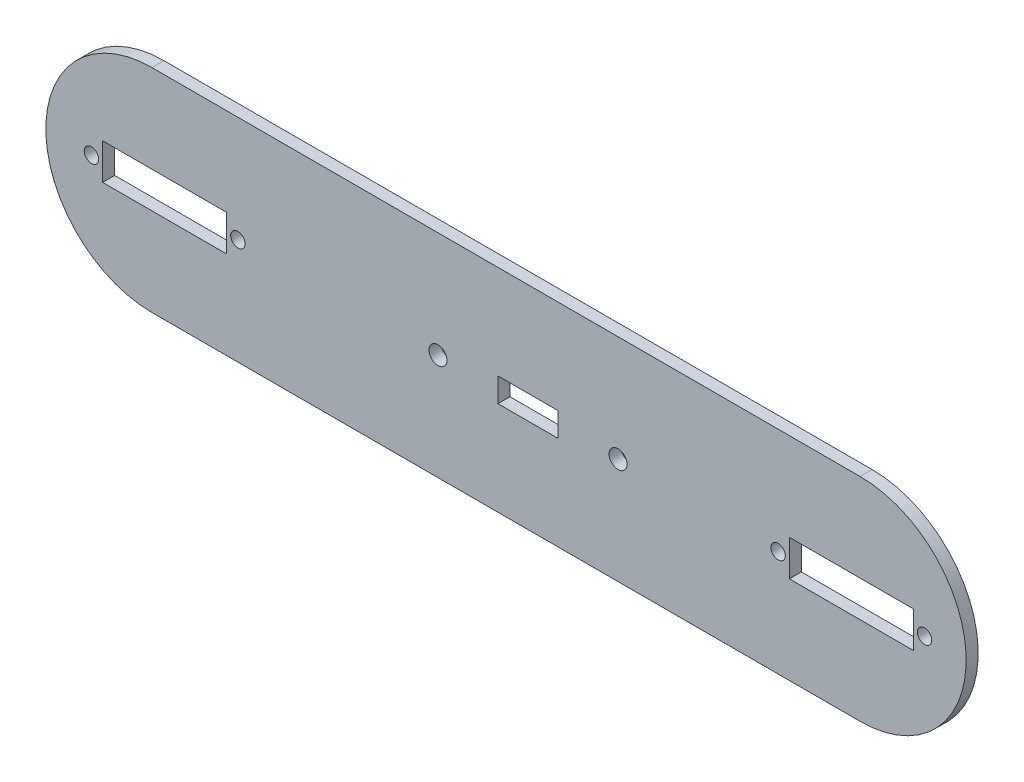
ISO-10303-21;
HEADER;
FILE_DESCRIPTION(('STEP AP214'),'2;1');
FILE_NAME('part.step','',(''),(''),'','','');
FILE_SCHEMA(('AUTOMOTIVE_DESIGN { 1 0 10303 214 1 1 1 1 }'));
ENDSEC;
DATA;
#1=APPLICATION_CONTEXT('core data for automotive mechanical design processes');
#2=APPLICATION_PROTOCOL_DEFINITION('international standard','automotive_design',2000,#1);
#3=PRODUCT_CONTEXT('',#1,'mechanical');
#4=PRODUCT('Part','Part','',(#3));
#5=PRODUCT_RELATED_PRODUCT_CATEGORY('part','',(#4));
#6=PRODUCT_DEFINITION_FORMATION('','',#4);
#7=PRODUCT_DEFINITION_CONTEXT('part definition',#1,'design');
#8=PRODUCT_DEFINITION('design','',#6,#7);
#9=PRODUCT_DEFINITION_SHAPE('','',#8);
#10=(LENGTH_UNIT() NAMED_UNIT(*) SI_UNIT(.MILLI.,.METRE.));
#11=(NAMED_UNIT(*) PLANE_ANGLE_UNIT() SI_UNIT($,.RADIAN.));
#12=(NAMED_UNIT(*) SI_UNIT($,.STERADIAN.) SOLID_ANGLE_UNIT());
#13=UNCERTAINTY_MEASURE_WITH_UNIT(LENGTH_MEASURE(1.E-05),#10,'distance_accuracy_value','');
#14=(GEOMETRIC_REPRESENTATION_CONTEXT(3) GLOBAL_UNCERTAINTY_ASSIGNED_CONTEXT((#13)) GLOBAL_UNIT_ASSIGNED_CONTEXT((#10,
#11,#12)) REPRESENTATION_CONTEXT('',''));
#15=CARTESIAN_POINT('',(0.,0.,0.));
#16=DIRECTION('',(0.,0.,1.));
#17=DIRECTION('',(1.,0.,0.));
#18=AXIS2_PLACEMENT_3D('',#15,#16,#17);
#19=CARTESIAN_POINT('',(-94.,0.,3.));
#20=DIRECTION('',(0.,0.,1.));
#21=DIRECTION('',(1.,0.,0.));
#22=AXIS2_PLACEMENT_3D('',#19,#20,#21);
#23=PLANE('',#22);
#24=CARTESIAN_POINT('',(62.5,0.,3.));
#25=DIRECTION('',(0.,0.,1.));
#26=DIRECTION('',(-1.,0.,0.));
#27=AXIS2_PLACEMENT_3D('',#24,#25,#26);
#28=CIRCLE('',#27,1.79999999999999);
#29=CARTESIAN_POINT('',(60.7,0.,3.));
#30=VERTEX_POINT('',#29);
#31=EDGE_CURVE('E219',#30,#30,#28,.T.);
#32=ORIENTED_EDGE('',*,*,#31,.F.);
#33=EDGE_LOOP('',(#32));
#34=FACE_BOUND('',#33,.T.);
#35=CARTESIAN_POINT('',(-109.1,0.,3.));
#36=DIRECTION('',(0.,0.,1.));
#37=DIRECTION('',(1.,0.,0.));
#38=AXIS2_PLACEMENT_3D('',#35,#36,#37);
#39=CIRCLE('',#38,1.79999999999999);
#40=CARTESIAN_POINT('',(-107.3,0.,3.));
#41=VERTEX_POINT('',#40);
#42=EDGE_CURVE('E231',#41,#41,#39,.T.);
#43=ORIENTED_EDGE('',*,*,#42,.F.);
#44=EDGE_LOOP('',(#43));
#45=FACE_BOUND('',#44,.T.);
#46=DIRECTION('',(-1.,0.,0.));
#47=VECTOR('',#46,1.);
#48=CARTESIAN_POINT('',(-7.5,3.,3.));
#49=LINE('',#48,#47);
#50=CARTESIAN_POINT('',(7.5,3.,3.));
#51=VERTEX_POINT('',#50);
#52=CARTESIAN_POINT('',(-7.5,3.,3.));
#53=VERTEX_POINT('',#52);
#54=EDGE_CURVE('E245',#51,#53,#49,.T.);
#55=ORIENTED_EDGE('',*,*,#54,.F.);
#56=DIRECTION('',(0.,1.,0.));
#57=VECTOR('',#56,1.);
#58=CARTESIAN_POINT('',(7.5,-3.,3.));
#59=LINE('',#58,#57);
#60=CARTESIAN_POINT('',(7.5,-3.,3.));
#61=VERTEX_POINT('',#60);
#62=EDGE_CURVE('E243',#61,#51,#59,.T.);
#63=ORIENTED_EDGE('',*,*,#62,.F.);
#64=DIRECTION('',(1.,0.,0.));
#65=VECTOR('',#64,1.);
#66=CARTESIAN_POINT('',(-7.5,-3.,3.));
#67=LINE('',#66,#65);
#68=CARTESIAN_POINT('',(-7.49999999999999,-3.,3.));
#69=VERTEX_POINT('',#68);
#70=EDGE_CURVE('E251',#69,#61,#67,.T.);
#71=ORIENTED_EDGE('',*,*,#70,.F.);
#72=DIRECTION('',(0.,-1.,0.));
#73=VECTOR('',#72,1.);
#74=CARTESIAN_POINT('',(-7.5,-3.,3.));
#75=LINE('',#74,#73);
#76=EDGE_CURVE('E248',#53,#69,#75,.T.);
#77=ORIENTED_EDGE('',*,*,#76,.F.);
#78=EDGE_LOOP('',(#55,#63,#71,#77));
#79=FACE_BOUND('',#78,.T.);
#80=CARTESIAN_POINT('',(-22.5,0.,3.));
#81=DIRECTION('',(0.,0.,1.));
#82=DIRECTION('',(1.,0.,0.));
#83=AXIS2_PLACEMENT_3D('',#80,#81,#82);
#84=CIRCLE('',#83,2.25);
#85=CARTESIAN_POINT('',(-20.25,0.,3.));
#86=VERTEX_POINT('',#85);
#87=EDGE_CURVE('E274',#86,#86,#84,.T.);
#88=ORIENTED_EDGE('',*,*,#87,.F.);
#89=EDGE_LOOP('',(#88));
#90=FACE_BOUND('',#89,.T.);
#91=CARTESIAN_POINT('',(-94.,0.,3.));
#92=DIRECTION('',(0.,0.,1.));
#93=DIRECTION('',(1.,0.,0.));
#94=AXIS2_PLACEMENT_3D('',#91,#92,#93);
#95=CIRCLE('',#94,26.5);
#96=CARTESIAN_POINT('',(-94.,26.5,3.));
#97=VERTEX_POINT('',#96);
#98=CARTESIAN_POINT('',(-94.,-26.5,3.));
#99=VERTEX_POINT('',#98);
#100=EDGE_CURVE('E280',#97,#99,#95,.T.);
#101=ORIENTED_EDGE('',*,*,#100,.T.);
#102=DIRECTION('',(1.,0.,0.));
#103=VECTOR('',#102,1.);
#104=CARTESIAN_POINT('',(-94.,-26.5,3.));
#105=LINE('',#104,#103);
#106=CARTESIAN_POINT('',(83.,-26.5,3.));
#107=VERTEX_POINT('',#106);
#108=EDGE_CURVE('E283',#99,#107,#105,.T.);
#109=ORIENTED_EDGE('',*,*,#108,.T.);
#110=CARTESIAN_POINT('',(83.,0.,3.));
#111=DIRECTION('',(0.,0.,1.));
#112=DIRECTION('',(1.,0.,0.));
#113=AXIS2_PLACEMENT_3D('',#110,#111,#112);
#114=CIRCLE('',#113,26.5);
#115=CARTESIAN_POINT('',(83.,26.5,3.));
#116=VERTEX_POINT('',#115);
#117=EDGE_CURVE('E286',#107,#116,#114,.T.);
#118=ORIENTED_EDGE('',*,*,#117,.T.);
#119=DIRECTION('',(-1.,0.,0.));
#120=VECTOR('',#119,1.);
#121=CARTESIAN_POINT('',(-94.,26.5,3.));
#122=LINE('',#121,#120);
#123=EDGE_CURVE('E288',#116,#97,#122,.T.);
#124=ORIENTED_EDGE('',*,*,#123,.T.);
#125=EDGE_LOOP('',(#101,#109,#118,#124));
#126=FACE_BOUND('',#125,.T.);
#127=CARTESIAN_POINT('',(22.5,0.,3.));
#128=DIRECTION('',(0.,0.,1.));
#129=DIRECTION('',(1.,0.,0.));
#130=AXIS2_PLACEMENT_3D('',#127,#128,#129);
#131=CIRCLE('',#130,2.25);
#132=CARTESIAN_POINT('',(24.75,0.,3.));
#133=VERTEX_POINT('',#132);
#134=EDGE_CURVE('E237',#133,#133,#131,.T.);
#135=ORIENTED_EDGE('',*,*,#134,.F.);
#136=EDGE_LOOP('',(#135));
#137=FACE_BOUND('',#136,.T.);
#138=CARTESIAN_POINT('',(-72.5,0.,3.));
#139=DIRECTION('',(0.,0.,1.));
#140=DIRECTION('',(1.,0.,0.));
#141=AXIS2_PLACEMENT_3D('',#138,#139,#140);
#142=CIRCLE('',#141,1.79999999999999);
#143=CARTESIAN_POINT('',(-70.7,0.,3.));
#144=VERTEX_POINT('',#143);
#145=EDGE_CURVE('E225',#144,#144,#142,.T.);
#146=ORIENTED_EDGE('',*,*,#145,.F.);
#147=EDGE_LOOP('',(#146));
#148=FACE_BOUND('',#147,.T.);
#149=CARTESIAN_POINT('',(99.1,0.,3.));
#150=DIRECTION('',(0.,0.,1.));
#151=DIRECTION('',(-1.,0.,0.));
#152=AXIS2_PLACEMENT_3D('',#149,#150,#151);
#153=CIRCLE('',#152,1.79999999999999);
#154=CARTESIAN_POINT('',(97.3,0.,3.));
#155=VERTEX_POINT('',#154);
#156=EDGE_CURVE('E213',#155,#155,#153,.T.);
#157=ORIENTED_EDGE('',*,*,#156,.F.);
#158=EDGE_LOOP('',(#157));
#159=FACE_BOUND('',#158,.T.);
#160=DIRECTION('',(-1.,0.,0.));
#161=VECTOR('',#160,1.);
#162=CARTESIAN_POINT('',(-106.3,4.5,3.));
#163=LINE('',#162,#161);
#164=CARTESIAN_POINT('',(-75.3000000000001,4.5,3.));
#165=VERTEX_POINT('',#164);
#166=CARTESIAN_POINT('',(-106.3,4.5,3.));
#167=VERTEX_POINT('',#166);
#168=EDGE_CURVE('E184',#165,#167,#163,.T.);
#169=ORIENTED_EDGE('',*,*,#168,.F.);
#170=DIRECTION('',(0.,1.,0.));
#171=VECTOR('',#170,1.);
#172=CARTESIAN_POINT('',(-75.3000000000001,-4.5,3.));
#173=LINE('',#172,#171);
#174=CARTESIAN_POINT('',(-75.3000000000001,-4.5,3.));
#175=VERTEX_POINT('',#174);
#176=EDGE_CURVE('E182',#175,#165,#173,.T.);
#177=ORIENTED_EDGE('',*,*,#176,.F.);
#178=DIRECTION('',(1.,0.,0.));
#179=VECTOR('',#178,1.);
#180=CARTESIAN_POINT('',(-106.3,-4.5,3.));
#181=LINE('',#180,#179);
#182=CARTESIAN_POINT('',(-106.3,-4.5,3.));
#183=VERTEX_POINT('',#182);
#184=EDGE_CURVE('E190',#183,#175,#181,.T.);
#185=ORIENTED_EDGE('',*,*,#184,.F.);
#186=DIRECTION('',(0.,-1.,0.));
#187=VECTOR('',#186,1.);
#188=CARTESIAN_POINT('',(-106.3,4.5,3.));
#189=LINE('',#188,#187);
#190=EDGE_CURVE('E187',#167,#183,#189,.T.);
#191=ORIENTED_EDGE('',*,*,#190,.F.);
#192=EDGE_LOOP('',(#169,#177,#185,#191));
#193=FACE_BOUND('',#192,.T.);
#194=DIRECTION('',(-1.,0.,0.));
#195=VECTOR('',#194,1.);
#196=CARTESIAN_POINT('',(65.3,4.5,3.));
#197=LINE('',#196,#195);
#198=CARTESIAN_POINT('',(96.3,4.5,3.));
#199=VERTEX_POINT('',#198);
#200=CARTESIAN_POINT('',(65.3,4.5,3.));
#201=VERTEX_POINT('',#200);
#202=EDGE_CURVE('E154',#199,#201,#197,.T.);
#203=ORIENTED_EDGE('',*,*,#202,.F.);
#204=DIRECTION('',(0.,1.,0.));
#205=VECTOR('',#204,1.);
#206=CARTESIAN_POINT('',(96.3,-4.5,3.));
#207=LINE('',#206,#205);
#208=CARTESIAN_POINT('',(96.3,-4.5,3.));
#209=VERTEX_POINT('',#208);
#210=EDGE_CURVE('E146',#209,#199,#207,.T.);
#211=ORIENTED_EDGE('',*,*,#210,.F.);
#212=DIRECTION('',(1.,0.,0.));
#213=VECTOR('',#212,1.);
#214=CARTESIAN_POINT('',(65.3,-4.5,3.));
#215=LINE('',#214,#213);
#216=CARTESIAN_POINT('',(65.3,-4.5,3.));
#217=VERTEX_POINT('',#216);
#218=EDGE_CURVE('E168',#217,#209,#215,.T.);
#219=ORIENTED_EDGE('',*,*,#218,.F.);
#220=DIRECTION('',(0.,-1.,0.));
#221=VECTOR('',#220,1.);
#222=CARTESIAN_POINT('',(65.3,-4.5,3.));
#223=LINE('',#222,#221);
#224=EDGE_CURVE('E166',#201,#217,#223,.T.);
#225=ORIENTED_EDGE('',*,*,#224,.F.);
#226=EDGE_LOOP('',(#203,#211,#219,#225));
#227=FACE_BOUND('',#226,.T.);
#228=ADVANCED_FACE('F33',(#34,#45,#79,#90,#126,#137,#148,#159,#193,#227),#23,.T.);
#229=CARTESIAN_POINT('',(-94.,0.,0.));
#230=DIRECTION('',(0.,0.,1.));
#231=DIRECTION('',(1.,0.,0.));
#232=AXIS2_PLACEMENT_3D('',#229,#230,#231);
#233=PLANE('',#232);
#234=DIRECTION('',(0.,1.,0.));
#235=VECTOR('',#234,1.);
#236=CARTESIAN_POINT('',(-75.3000000000001,-4.5,0.));
#237=LINE('',#236,#235);
#238=CARTESIAN_POINT('',(-75.3000000000001,-4.5,0.));
#239=VERTEX_POINT('',#238);
#240=CARTESIAN_POINT('',(-75.3000000000001,4.5,0.));
#241=VERTEX_POINT('',#240);
#242=EDGE_CURVE('E162',#239,#241,#237,.T.);
#243=ORIENTED_EDGE('',*,*,#242,.T.);
#244=DIRECTION('',(-1.,0.,0.));
#245=VECTOR('',#244,1.);
#246=CARTESIAN_POINT('',(-106.3,4.5,0.));
#247=LINE('',#246,#245);
#248=CARTESIAN_POINT('',(-106.3,4.5,0.));
#249=VERTEX_POINT('',#248);
#250=EDGE_CURVE('E195',#241,#249,#247,.T.);
#251=ORIENTED_EDGE('',*,*,#250,.T.);
#252=DIRECTION('',(0.,-1.,0.));
#253=VECTOR('',#252,1.);
#254=CARTESIAN_POINT('',(-106.3,4.5,0.));
#255=LINE('',#254,#253);
#256=CARTESIAN_POINT('',(-106.3,-4.5,0.));
#257=VERTEX_POINT('',#256);
#258=EDGE_CURVE('E198',#249,#257,#255,.T.);
#259=ORIENTED_EDGE('',*,*,#258,.T.);
#260=DIRECTION('',(1.,0.,0.));
#261=VECTOR('',#260,1.);
#262=CARTESIAN_POINT('',(-106.3,-4.5,0.));
#263=LINE('',#262,#261);
#264=EDGE_CURVE('E185',#257,#239,#263,.T.);
#265=ORIENTED_EDGE('',*,*,#264,.T.);
#266=EDGE_LOOP('',(#243,#251,#259,#265));
#267=FACE_BOUND('',#266,.T.);
#268=CARTESIAN_POINT('',(-22.5,0.,0.));
#269=DIRECTION('',(0.,0.,1.));
#270=DIRECTION('',(1.,0.,0.));
#271=AXIS2_PLACEMENT_3D('',#268,#269,#270);
#272=CIRCLE('',#271,2.25);
#273=CARTESIAN_POINT('',(-20.25,0.,0.));
#274=VERTEX_POINT('',#273);
#275=EDGE_CURVE('E273',#274,#274,#272,.T.);
#276=ORIENTED_EDGE('',*,*,#275,.T.);
#277=EDGE_LOOP('',(#276));
#278=FACE_BOUND('',#277,.T.);
#279=CARTESIAN_POINT('',(-94.,0.,0.));
#280=DIRECTION('',(0.,0.,1.));
#281=DIRECTION('',(1.,0.,0.));
#282=AXIS2_PLACEMENT_3D('',#279,#280,#281);
#283=CIRCLE('',#282,26.5);
#284=CARTESIAN_POINT('',(-94.,26.5,0.));
#285=VERTEX_POINT('',#284);
#286=CARTESIAN_POINT('',(-94.,-26.5,0.));
#287=VERTEX_POINT('',#286);
#288=EDGE_CURVE('E277',#285,#287,#283,.T.);
#289=ORIENTED_EDGE('',*,*,#288,.F.);
#290=DIRECTION('',(-1.,0.,0.));
#291=VECTOR('',#290,1.);
#292=CARTESIAN_POINT('',(-94.,26.5,0.));
#293=LINE('',#292,#291);
#294=CARTESIAN_POINT('',(83.,26.5,0.));
#295=VERTEX_POINT('',#294);
#296=EDGE_CURVE('E284',#295,#285,#293,.T.);
#297=ORIENTED_EDGE('',*,*,#296,.F.);
#298=CARTESIAN_POINT('',(83.,0.,0.));
#299=DIRECTION('',(0.,0.,1.));
#300=DIRECTION('',(1.,0.,0.));
#301=AXIS2_PLACEMENT_3D('',#298,#299,#300);
#302=CIRCLE('',#301,26.5);
#303=CARTESIAN_POINT('',(83.,-26.5,0.));
#304=VERTEX_POINT('',#303);
#305=EDGE_CURVE('E295',#304,#295,#302,.T.);
#306=ORIENTED_EDGE('',*,*,#305,.F.);
#307=DIRECTION('',(1.,0.,0.));
#308=VECTOR('',#307,1.);
#309=CARTESIAN_POINT('',(-94.,-26.5,0.));
#310=LINE('',#309,#308);
#311=EDGE_CURVE('E293',#287,#304,#310,.T.);
#312=ORIENTED_EDGE('',*,*,#311,.F.);
#313=EDGE_LOOP('',(#289,#297,#306,#312));
#314=FACE_BOUND('',#313,.T.);
#315=DIRECTION('',(0.,1.,0.));
#316=VECTOR('',#315,1.);
#317=CARTESIAN_POINT('',(7.5,-3.,0.));
#318=LINE('',#317,#316);
#319=CARTESIAN_POINT('',(7.49999999999999,-3.,0.));
#320=VERTEX_POINT('',#319);
#321=CARTESIAN_POINT('',(7.5,3.,0.));
#322=VERTEX_POINT('',#321);
#323=EDGE_CURVE('E240',#320,#322,#318,.T.);
#324=ORIENTED_EDGE('',*,*,#323,.T.);
#325=DIRECTION('',(-1.,0.,0.));
#326=VECTOR('',#325,1.);
#327=CARTESIAN_POINT('',(-7.5,3.,0.));
#328=LINE('',#327,#326);
#329=CARTESIAN_POINT('',(-7.5,3.,0.));
#330=VERTEX_POINT('',#329);
#331=EDGE_CURVE('E256',#322,#330,#328,.T.);
#332=ORIENTED_EDGE('',*,*,#331,.T.);
#333=DIRECTION('',(0.,-1.,0.));
#334=VECTOR('',#333,1.);
#335=CARTESIAN_POINT('',(-7.5,-3.,0.));
#336=LINE('',#335,#334);
#337=CARTESIAN_POINT('',(-7.5,-3.,0.));
#338=VERTEX_POINT('',#337);
#339=EDGE_CURVE('E259',#330,#338,#336,.T.);
#340=ORIENTED_EDGE('',*,*,#339,.T.);
#341=DIRECTION('',(1.,0.,0.));
#342=VECTOR('',#341,1.);
#343=CARTESIAN_POINT('',(-7.5,-3.,0.));
#344=LINE('',#343,#342);
#345=EDGE_CURVE('E246',#338,#320,#344,.T.);
#346=ORIENTED_EDGE('',*,*,#345,.T.);
#347=EDGE_LOOP('',(#324,#332,#340,#346));
#348=FACE_BOUND('',#347,.T.);
#349=CARTESIAN_POINT('',(22.5,0.,0.));
#350=DIRECTION('',(0.,0.,1.));
#351=DIRECTION('',(1.,0.,0.));
#352=AXIS2_PLACEMENT_3D('',#349,#350,#351);
#353=CIRCLE('',#352,2.25);
#354=CARTESIAN_POINT('',(24.75,0.,0.));
#355=VERTEX_POINT('',#354);
#356=EDGE_CURVE('E234',#355,#355,#353,.T.);
#357=ORIENTED_EDGE('',*,*,#356,.T.);
#358=EDGE_LOOP('',(#357));
#359=FACE_BOUND('',#358,.T.);
#360=CARTESIAN_POINT('',(-109.1,0.,0.));
#361=DIRECTION('',(0.,0.,1.));
#362=DIRECTION('',(1.,0.,0.));
#363=AXIS2_PLACEMENT_3D('',#360,#361,#362);
#364=CIRCLE('',#363,1.79999999999999);
#365=CARTESIAN_POINT('',(-107.3,0.,0.));
#366=VERTEX_POINT('',#365);
#367=EDGE_CURVE('E228',#366,#366,#364,.T.);
#368=ORIENTED_EDGE('',*,*,#367,.T.);
#369=EDGE_LOOP('',(#368));
#370=FACE_BOUND('',#369,.T.);
#371=CARTESIAN_POINT('',(-72.5,0.,0.));
#372=DIRECTION('',(0.,0.,1.));
#373=DIRECTION('',(1.,0.,0.));
#374=AXIS2_PLACEMENT_3D('',#371,#372,#373);
#375=CIRCLE('',#374,1.79999999999999);
#376=CARTESIAN_POINT('',(-70.7,0.,0.));
#377=VERTEX_POINT('',#376);
#378=EDGE_CURVE('E222',#377,#377,#375,.T.);
#379=ORIENTED_EDGE('',*,*,#378,.T.);
#380=EDGE_LOOP('',(#379));
#381=FACE_BOUND('',#380,.T.);
#382=CARTESIAN_POINT('',(62.5,0.,0.));
#383=DIRECTION('',(0.,0.,1.));
#384=DIRECTION('',(-1.,0.,0.));
#385=AXIS2_PLACEMENT_3D('',#382,#383,#384);
#386=CIRCLE('',#385,1.79999999999999);
#387=CARTESIAN_POINT('',(60.7,0.,0.));
#388=VERTEX_POINT('',#387);
#389=EDGE_CURVE('E216',#388,#388,#386,.T.);
#390=ORIENTED_EDGE('',*,*,#389,.T.);
#391=EDGE_LOOP('',(#390));
#392=FACE_BOUND('',#391,.T.);
#393=CARTESIAN_POINT('',(99.1,0.,0.));
#394=DIRECTION('',(0.,0.,1.));
#395=DIRECTION('',(-1.,0.,0.));
#396=AXIS2_PLACEMENT_3D('',#393,#394,#395);
#397=CIRCLE('',#396,1.79999999999999);
#398=CARTESIAN_POINT('',(97.3,0.,0.));
#399=VERTEX_POINT('',#398);
#400=EDGE_CURVE('E212',#399,#399,#397,.T.);
#401=ORIENTED_EDGE('',*,*,#400,.T.);
#402=EDGE_LOOP('',(#401));
#403=FACE_BOUND('',#402,.T.);
#404=DIRECTION('',(0.,1.,0.));
#405=VECTOR('',#404,1.);
#406=CARTESIAN_POINT('',(96.3,-4.5,0.));
#407=LINE('',#406,#405);
#408=CARTESIAN_POINT('',(96.3,-4.5,0.));
#409=VERTEX_POINT('',#408);
#410=CARTESIAN_POINT('',(96.3,4.5,0.));
#411=VERTEX_POINT('',#410);
#412=EDGE_CURVE('E56',#409,#411,#407,.T.);
#413=ORIENTED_EDGE('',*,*,#412,.T.);
#414=DIRECTION('',(-1.,0.,0.));
#415=VECTOR('',#414,1.);
#416=CARTESIAN_POINT('',(65.3,4.5,0.));
#417=LINE('',#416,#415);
#418=CARTESIAN_POINT('',(65.3,4.5,0.));
#419=VERTEX_POINT('',#418);
#420=EDGE_CURVE('E161',#411,#419,#417,.T.);
#421=ORIENTED_EDGE('',*,*,#420,.T.);
#422=DIRECTION('',(0.,-1.,0.));
#423=VECTOR('',#422,1.);
#424=CARTESIAN_POINT('',(65.3,-4.5,0.));
#425=LINE('',#424,#423);
#426=CARTESIAN_POINT('',(65.3,-4.5,0.));
#427=VERTEX_POINT('',#426);
#428=EDGE_CURVE('E174',#419,#427,#425,.T.);
#429=ORIENTED_EDGE('',*,*,#428,.T.);
#430=DIRECTION('',(1.,0.,0.));
#431=VECTOR('',#430,1.);
#432=CARTESIAN_POINT('',(65.3,-4.5,0.));
#433=LINE('',#432,#431);
#434=EDGE_CURVE('E155',#427,#409,#433,.T.);
#435=ORIENTED_EDGE('',*,*,#434,.T.);
#436=EDGE_LOOP('',(#413,#421,#429,#435));
#437=FACE_BOUND('',#436,.T.);
#438=ADVANCED_FACE('F313',(#267,#278,#314,#348,#359,#370,#381,#392,#403,#437),#233,.F.);
#439=CARTESIAN_POINT('',(-94.,0.,3.));
#440=DIRECTION('',(0.,0.,-1.));
#441=DIRECTION('',(-1.,0.,0.));
#442=AXIS2_PLACEMENT_3D('',#439,#440,#441);
#443=CYLINDRICAL_SURFACE('',#442,26.5);
#444=ORIENTED_EDGE('',*,*,#288,.T.);
#445=DIRECTION('',(0.,0.,-1.));
#446=VECTOR('',#445,1.);
#447=CARTESIAN_POINT('',(-94.,-26.5,3.));
#448=LINE('',#447,#446);
#449=EDGE_CURVE('E11',#99,#287,#448,.T.);
#450=ORIENTED_EDGE('',*,*,#449,.F.);
#451=ORIENTED_EDGE('',*,*,#100,.F.);
#452=DIRECTION('',(0.,0.,-1.));
#453=VECTOR('',#452,1.);
#454=CARTESIAN_POINT('',(-94.,26.5,3.));
#455=LINE('',#454,#453);
#456=EDGE_CURVE('E290',#97,#285,#455,.T.);
#457=ORIENTED_EDGE('',*,*,#456,.T.);
#458=EDGE_LOOP('',(#444,#450,#451,#457));
#459=FACE_BOUND('',#458,.T.);
#460=ADVANCED_FACE('F35',(#459),#443,.T.);
#461=CARTESIAN_POINT('',(-94.,-26.5,3.));
#462=DIRECTION('',(0.,1.,0.));
#463=DIRECTION('',(0.,0.,1.));
#464=AXIS2_PLACEMENT_3D('',#461,#462,#463);
#465=PLANE('',#464);
#466=ORIENTED_EDGE('',*,*,#311,.T.);
#467=DIRECTION('',(0.,0.,-1.));
#468=VECTOR('',#467,1.);
#469=CARTESIAN_POINT('',(83.,-26.5,3.));
#470=LINE('',#469,#468);
#471=EDGE_CURVE('E41',#107,#304,#470,.T.);
#472=ORIENTED_EDGE('',*,*,#471,.F.);
#473=ORIENTED_EDGE('',*,*,#108,.F.);
#474=ORIENTED_EDGE('',*,*,#449,.T.);
#475=EDGE_LOOP('',(#466,#472,#473,#474));
#476=FACE_BOUND('',#475,.T.);
#477=ADVANCED_FACE('F324',(#476),#465,.F.);
#478=CARTESIAN_POINT('',(83.,0.,3.));
#479=DIRECTION('',(0.,0.,-1.));
#480=DIRECTION('',(-1.,0.,0.));
#481=AXIS2_PLACEMENT_3D('',#478,#479,#480);
#482=CYLINDRICAL_SURFACE('',#481,26.5);
#483=ORIENTED_EDGE('',*,*,#305,.T.);
#484=DIRECTION('',(0.,0.,-1.));
#485=VECTOR('',#484,1.);
#486=CARTESIAN_POINT('',(83.,26.5,3.));
#487=LINE('',#486,#485);
#488=EDGE_CURVE('E300',#116,#295,#487,.T.);
#489=ORIENTED_EDGE('',*,*,#488,.F.);
#490=ORIENTED_EDGE('',*,*,#117,.F.);
#491=ORIENTED_EDGE('',*,*,#471,.T.);
#492=EDGE_LOOP('',(#483,#489,#490,#491));
#493=FACE_BOUND('',#492,.T.);
#494=ADVANCED_FACE('F307',(#493),#482,.T.);
#495=CARTESIAN_POINT('',(-94.,26.5,3.));
#496=DIRECTION('',(0.,-1.,0.));
#497=DIRECTION('',(0.,0.,-1.));
#498=AXIS2_PLACEMENT_3D('',#495,#496,#497);
#499=PLANE('',#498);
#500=ORIENTED_EDGE('',*,*,#296,.T.);
#501=ORIENTED_EDGE('',*,*,#456,.F.);
#502=ORIENTED_EDGE('',*,*,#123,.F.);
#503=ORIENTED_EDGE('',*,*,#488,.T.);
#504=EDGE_LOOP('',(#500,#501,#502,#503));
#505=FACE_BOUND('',#504,.T.);
#506=ADVANCED_FACE('F317',(#505),#499,.F.);
#507=CARTESIAN_POINT('',(-22.5,0.,3.));
#508=DIRECTION('',(0.,0.,-1.));
#509=DIRECTION('',(-1.,0.,0.));
#510=AXIS2_PLACEMENT_3D('',#507,#508,#509);
#511=CYLINDRICAL_SURFACE('',#510,2.25);
#512=ORIENTED_EDGE('',*,*,#87,.T.);
#513=EDGE_LOOP('',(#512));
#514=FACE_BOUND('',#513,.T.);
#515=ORIENTED_EDGE('',*,*,#275,.F.);
#516=EDGE_LOOP('',(#515));
#517=FACE_BOUND('',#516,.T.);
#518=ADVANCED_FACE('F342',(#514,#517),#511,.F.);
#519=CARTESIAN_POINT('',(7.5,-3.,3.));
#520=DIRECTION('',(-1.,0.,0.));
#521=DIRECTION('',(0.,0.,1.));
#522=AXIS2_PLACEMENT_3D('',#519,#520,#521);
#523=PLANE('',#522);
#524=ORIENTED_EDGE('',*,*,#323,.F.);
#525=DIRECTION('',(0.,0.,-1.));
#526=VECTOR('',#525,1.);
#527=CARTESIAN_POINT('',(7.5,-3.,3.));
#528=LINE('',#527,#526);
#529=EDGE_CURVE('E253',#61,#320,#528,.T.);
#530=ORIENTED_EDGE('',*,*,#529,.F.);
#531=ORIENTED_EDGE('',*,*,#62,.T.);
#532=DIRECTION('',(0.,0.,-1.));
#533=VECTOR('',#532,1.);
#534=CARTESIAN_POINT('',(7.5,3.,3.));
#535=LINE('',#534,#533);
#536=EDGE_CURVE('E270',#51,#322,#535,.T.);
#537=ORIENTED_EDGE('',*,*,#536,.T.);
#538=EDGE_LOOP('',(#524,#530,#531,#537));
#539=FACE_BOUND('',#538,.T.);
#540=ADVANCED_FACE('F349',(#539),#523,.T.);
#541=CARTESIAN_POINT('',(-7.5,3.,3.));
#542=DIRECTION('',(0.,-1.,0.));
#543=DIRECTION('',(0.,0.,-1.));
#544=AXIS2_PLACEMENT_3D('',#541,#542,#543);
#545=PLANE('',#544);
#546=ORIENTED_EDGE('',*,*,#331,.F.);
#547=ORIENTED_EDGE('',*,*,#536,.F.);
#548=ORIENTED_EDGE('',*,*,#54,.T.);
#549=DIRECTION('',(0.,0.,-1.));
#550=VECTOR('',#549,1.);
#551=CARTESIAN_POINT('',(-7.5,3.,3.));
#552=LINE('',#551,#550);
#553=EDGE_CURVE('E268',#53,#330,#552,.T.);
#554=ORIENTED_EDGE('',*,*,#553,.T.);
#555=EDGE_LOOP('',(#546,#547,#548,#554));
#556=FACE_BOUND('',#555,.T.);
#557=ADVANCED_FACE('F354',(#556),#545,.T.);
#558=CARTESIAN_POINT('',(-7.5,-3.,3.));
#559=DIRECTION('',(1.,0.,0.));
#560=DIRECTION('',(0.,0.,-1.));
#561=AXIS2_PLACEMENT_3D('',#558,#559,#560);
#562=PLANE('',#561);
#563=ORIENTED_EDGE('',*,*,#339,.F.);
#564=ORIENTED_EDGE('',*,*,#553,.F.);
#565=ORIENTED_EDGE('',*,*,#76,.T.);
#566=DIRECTION('',(0.,0.,-1.));
#567=VECTOR('',#566,1.);
#568=CARTESIAN_POINT('',(-7.5,-3.,3.));
#569=LINE('',#568,#567);
#570=EDGE_CURVE('E266',#69,#338,#569,.T.);
#571=ORIENTED_EDGE('',*,*,#570,.T.);
#572=EDGE_LOOP('',(#563,#564,#565,#571));
#573=FACE_BOUND('',#572,.T.);
#574=ADVANCED_FACE('F364',(#573),#562,.T.);
#575=CARTESIAN_POINT('',(-7.5,-3.,3.));
#576=DIRECTION('',(0.,1.,0.));
#577=DIRECTION('',(0.,0.,1.));
#578=AXIS2_PLACEMENT_3D('',#575,#576,#577);
#579=PLANE('',#578);
#580=ORIENTED_EDGE('',*,*,#345,.F.);
#581=ORIENTED_EDGE('',*,*,#570,.F.);
#582=ORIENTED_EDGE('',*,*,#70,.T.);
#583=ORIENTED_EDGE('',*,*,#529,.T.);
#584=EDGE_LOOP('',(#580,#581,#582,#583));
#585=FACE_BOUND('',#584,.T.);
#586=ADVANCED_FACE('F370',(#585),#579,.T.);
#587=CARTESIAN_POINT('',(22.5,0.,3.));
#588=DIRECTION('',(0.,0.,-1.));
#589=DIRECTION('',(-1.,0.,0.));
#590=AXIS2_PLACEMENT_3D('',#587,#588,#589);
#591=CYLINDRICAL_SURFACE('',#590,2.25);
#592=ORIENTED_EDGE('',*,*,#134,.T.);
#593=EDGE_LOOP('',(#592));
#594=FACE_BOUND('',#593,.T.);
#595=ORIENTED_EDGE('',*,*,#356,.F.);
#596=EDGE_LOOP('',(#595));
#597=FACE_BOUND('',#596,.T.);
#598=ADVANCED_FACE('F374',(#594,#597),#591,.F.);
#599=CARTESIAN_POINT('',(-109.1,0.,3.));
#600=DIRECTION('',(0.,0.,-1.));
#601=DIRECTION('',(-1.,0.,0.));
#602=AXIS2_PLACEMENT_3D('',#599,#600,#601);
#603=CYLINDRICAL_SURFACE('',#602,1.79999999999999);
#604=ORIENTED_EDGE('',*,*,#42,.T.);
#605=EDGE_LOOP('',(#604));
#606=FACE_BOUND('',#605,.T.);
#607=ORIENTED_EDGE('',*,*,#367,.F.);
#608=EDGE_LOOP('',(#607));
#609=FACE_BOUND('',#608,.T.);
#610=ADVANCED_FACE('F378',(#606,#609),#603,.F.);
#611=CARTESIAN_POINT('',(-72.5,0.,3.));
#612=DIRECTION('',(0.,0.,-1.));
#613=DIRECTION('',(-1.,0.,0.));
#614=AXIS2_PLACEMENT_3D('',#611,#612,#613);
#615=CYLINDRICAL_SURFACE('',#614,1.79999999999999);
#616=ORIENTED_EDGE('',*,*,#145,.T.);
#617=EDGE_LOOP('',(#616));
#618=FACE_BOUND('',#617,.T.);
#619=ORIENTED_EDGE('',*,*,#378,.F.);
#620=EDGE_LOOP('',(#619));
#621=FACE_BOUND('',#620,.T.);
#622=ADVANCED_FACE('F382',(#618,#621),#615,.F.);
#623=CARTESIAN_POINT('',(62.5,0.,3.));
#624=DIRECTION('',(0.,0.,-1.));
#625=DIRECTION('',(-1.,0.,0.));
#626=AXIS2_PLACEMENT_3D('',#623,#624,#625);
#627=CYLINDRICAL_SURFACE('',#626,1.79999999999999);
#628=ORIENTED_EDGE('',*,*,#31,.T.);
#629=EDGE_LOOP('',(#628));
#630=FACE_BOUND('',#629,.T.);
#631=ORIENTED_EDGE('',*,*,#389,.F.);
#632=EDGE_LOOP('',(#631));
#633=FACE_BOUND('',#632,.T.);
#634=ADVANCED_FACE('F386',(#630,#633),#627,.F.);
#635=CARTESIAN_POINT('',(99.1,0.,3.));
#636=DIRECTION('',(0.,0.,-1.));
#637=DIRECTION('',(-1.,0.,0.));
#638=AXIS2_PLACEMENT_3D('',#635,#636,#637);
#639=CYLINDRICAL_SURFACE('',#638,1.79999999999999);
#640=ORIENTED_EDGE('',*,*,#156,.T.);
#641=EDGE_LOOP('',(#640));
#642=FACE_BOUND('',#641,.T.);
#643=ORIENTED_EDGE('',*,*,#400,.F.);
#644=EDGE_LOOP('',(#643));
#645=FACE_BOUND('',#644,.T.);
#646=ADVANCED_FACE('F390',(#642,#645),#639,.F.);
#647=CARTESIAN_POINT('',(-75.3000000000001,-4.5,3.));
#648=DIRECTION('',(-1.,0.,0.));
#649=DIRECTION('',(0.,0.,1.));
#650=AXIS2_PLACEMENT_3D('',#647,#648,#649);
#651=PLANE('',#650);
#652=ORIENTED_EDGE('',*,*,#242,.F.);
#653=DIRECTION('',(0.,0.,-1.));
#654=VECTOR('',#653,1.);
#655=CARTESIAN_POINT('',(-75.3000000000001,-4.5,3.));
#656=LINE('',#655,#654);
#657=EDGE_CURVE('E192',#175,#239,#656,.T.);
#658=ORIENTED_EDGE('',*,*,#657,.F.);
#659=ORIENTED_EDGE('',*,*,#176,.T.);
#660=DIRECTION('',(0.,0.,-1.));
#661=VECTOR('',#660,1.);
#662=CARTESIAN_POINT('',(-75.3000000000001,4.5,3.));
#663=LINE('',#662,#661);
#664=EDGE_CURVE('E209',#165,#241,#663,.T.);
#665=ORIENTED_EDGE('',*,*,#664,.T.);
#666=EDGE_LOOP('',(#652,#658,#659,#665));
#667=FACE_BOUND('',#666,.T.);
#668=ADVANCED_FACE('F394',(#667),#651,.T.);
#669=CARTESIAN_POINT('',(-106.3,4.5,3.));
#670=DIRECTION('',(0.,-1.,0.));
#671=DIRECTION('',(0.,0.,-1.));
#672=AXIS2_PLACEMENT_3D('',#669,#670,#671);
#673=PLANE('',#672);
#674=ORIENTED_EDGE('',*,*,#250,.F.);
#675=ORIENTED_EDGE('',*,*,#664,.F.);
#676=ORIENTED_EDGE('',*,*,#168,.T.);
#677=DIRECTION('',(0.,0.,-1.));
#678=VECTOR('',#677,1.);
#679=CARTESIAN_POINT('',(-106.3,4.5,3.));
#680=LINE('',#679,#678);
#681=EDGE_CURVE('E207',#167,#249,#680,.T.);
#682=ORIENTED_EDGE('',*,*,#681,.T.);
#683=EDGE_LOOP('',(#674,#675,#676,#682));
#684=FACE_BOUND('',#683,.T.);
#685=ADVANCED_FACE('F398',(#684),#673,.T.);
#686=CARTESIAN_POINT('',(-106.3,4.5,3.));
#687=DIRECTION('',(1.,0.,0.));
#688=DIRECTION('',(0.,0.,-1.));
#689=AXIS2_PLACEMENT_3D('',#686,#687,#688);
#690=PLANE('',#689);
#691=ORIENTED_EDGE('',*,*,#258,.F.);
#692=ORIENTED_EDGE('',*,*,#681,.F.);
#693=ORIENTED_EDGE('',*,*,#190,.T.);
#694=DIRECTION('',(0.,0.,-1.));
#695=VECTOR('',#694,1.);
#696=CARTESIAN_POINT('',(-106.3,-4.5,3.));
#697=LINE('',#696,#695);
#698=EDGE_CURVE('E205',#183,#257,#697,.T.);
#699=ORIENTED_EDGE('',*,*,#698,.T.);
#700=EDGE_LOOP('',(#691,#692,#693,#699));
#701=FACE_BOUND('',#700,.T.);
#702=ADVANCED_FACE('F402',(#701),#690,.T.);
#703=CARTESIAN_POINT('',(-106.3,-4.5,3.));
#704=DIRECTION('',(0.,1.,0.));
#705=DIRECTION('',(0.,0.,1.));
#706=AXIS2_PLACEMENT_3D('',#703,#704,#705);
#707=PLANE('',#706);
#708=ORIENTED_EDGE('',*,*,#264,.F.);
#709=ORIENTED_EDGE('',*,*,#698,.F.);
#710=ORIENTED_EDGE('',*,*,#184,.T.);
#711=ORIENTED_EDGE('',*,*,#657,.T.);
#712=EDGE_LOOP('',(#708,#709,#710,#711));
#713=FACE_BOUND('',#712,.T.);
#714=ADVANCED_FACE('F406',(#713),#707,.T.);
#715=CARTESIAN_POINT('',(96.3,-4.5,3.));
#716=DIRECTION('',(-1.,0.,0.));
#717=DIRECTION('',(0.,0.,1.));
#718=AXIS2_PLACEMENT_3D('',#715,#716,#717);
#719=PLANE('',#718);
#720=ORIENTED_EDGE('',*,*,#412,.F.);
#721=DIRECTION('',(0.,0.,-1.));
#722=VECTOR('',#721,1.);
#723=CARTESIAN_POINT('',(96.3,-4.5,3.));
#724=LINE('',#723,#722);
#725=EDGE_CURVE('E150',#209,#409,#724,.T.);
#726=ORIENTED_EDGE('',*,*,#725,.F.);
#727=ORIENTED_EDGE('',*,*,#210,.T.);
#728=DIRECTION('',(0.,0.,-1.));
#729=VECTOR('',#728,1.);
#730=CARTESIAN_POINT('',(96.3,4.5,3.));
#731=LINE('',#730,#729);
#732=EDGE_CURVE('E149',#199,#411,#731,.T.);
#733=ORIENTED_EDGE('',*,*,#732,.T.);
#734=EDGE_LOOP('',(#720,#726,#727,#733));
#735=FACE_BOUND('',#734,.T.);
#736=ADVANCED_FACE('F148',(#735),#719,.T.);
#737=CARTESIAN_POINT('',(65.3,4.5,3.));
#738=DIRECTION('',(0.,-1.,0.));
#739=DIRECTION('',(0.,0.,-1.));
#740=AXIS2_PLACEMENT_3D('',#737,#738,#739);
#741=PLANE('',#740);
#742=ORIENTED_EDGE('',*,*,#420,.F.);
#743=ORIENTED_EDGE('',*,*,#732,.F.);
#744=ORIENTED_EDGE('',*,*,#202,.T.);
#745=DIRECTION('',(0.,0.,-1.));
#746=VECTOR('',#745,1.);
#747=CARTESIAN_POINT('',(65.3,4.5,3.));
#748=LINE('',#747,#746);
#749=EDGE_CURVE('E163',#201,#419,#748,.T.);
#750=ORIENTED_EDGE('',*,*,#749,.T.);
#751=EDGE_LOOP('',(#742,#743,#744,#750));
#752=FACE_BOUND('',#751,.T.);
#753=ADVANCED_FACE('F158',(#752),#741,.T.);
#754=CARTESIAN_POINT('',(65.3,-4.5,3.));
#755=DIRECTION('',(1.,0.,0.));
#756=DIRECTION('',(0.,0.,-1.));
#757=AXIS2_PLACEMENT_3D('',#754,#755,#756);
#758=PLANE('',#757);
#759=ORIENTED_EDGE('',*,*,#428,.F.);
#760=ORIENTED_EDGE('',*,*,#749,.F.);
#761=ORIENTED_EDGE('',*,*,#224,.T.);
#762=DIRECTION('',(0.,0.,-1.));
#763=VECTOR('',#762,1.);
#764=CARTESIAN_POINT('',(65.3,-4.5,3.));
#765=LINE('',#764,#763);
#766=EDGE_CURVE('E48',#217,#427,#765,.T.);
#767=ORIENTED_EDGE('',*,*,#766,.T.);
#768=EDGE_LOOP('',(#759,#760,#761,#767));
#769=FACE_BOUND('',#768,.T.);
#770=ADVANCED_FACE('F415',(#769),#758,.T.);
#771=CARTESIAN_POINT('',(65.3,-4.5,3.));
#772=DIRECTION('',(0.,1.,0.));
#773=DIRECTION('',(0.,0.,1.));
#774=AXIS2_PLACEMENT_3D('',#771,#772,#773);
#775=PLANE('',#774);
#776=ORIENTED_EDGE('',*,*,#434,.F.);
#777=ORIENTED_EDGE('',*,*,#766,.F.);
#778=ORIENTED_EDGE('',*,*,#218,.T.);
#779=ORIENTED_EDGE('',*,*,#725,.T.);
#780=EDGE_LOOP('',(#776,#777,#778,#779));
#781=FACE_BOUND('',#780,.T.);
#782=ADVANCED_FACE('F418',(#781),#775,.T.);
#783=CLOSED_SHELL('',(#228,#438,#460,#477,#494,#506,#518,#540,#557,#574,#586,#598,#610,#622,
#634,#646,#668,#685,#702,#714,#736,#753,#770,#782));
#784=MANIFOLD_SOLID_BREP('B2',#783);
#785=ADVANCED_BREP_SHAPE_REPRESENTATION('',(#18,#784),#14);
#786=SHAPE_DEFINITION_REPRESENTATION(#9,#785);
ENDSEC;
END-ISO-10303-21;
